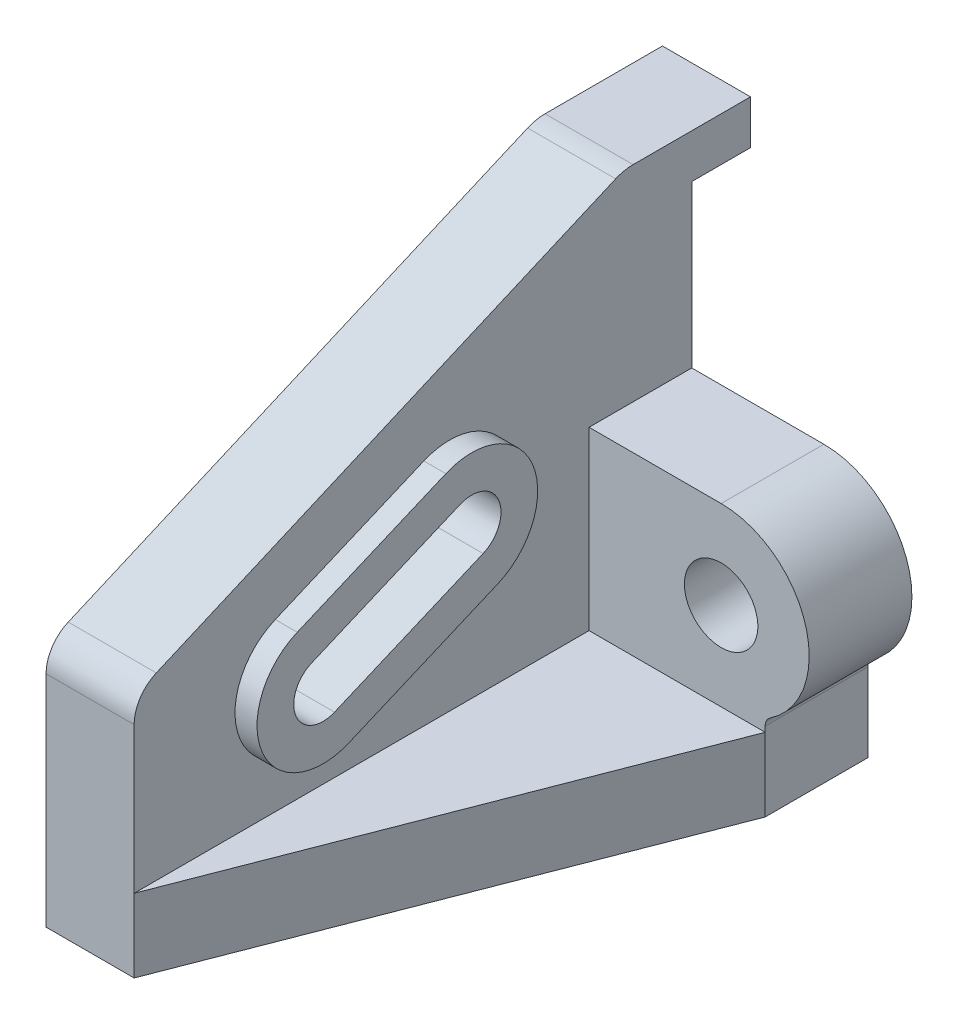
ISO-10303-21;
HEADER;
FILE_DESCRIPTION(('STEP AP214'),'2;1');
FILE_NAME('part.step','',(''),(''),'','','');
FILE_SCHEMA(('AUTOMOTIVE_DESIGN { 1 0 10303 214 1 1 1 1 }'));
ENDSEC;
DATA;
#1=APPLICATION_CONTEXT('core data for automotive mechanical design processes');
#2=APPLICATION_PROTOCOL_DEFINITION('international standard','automotive_design',2000,#1);
#3=PRODUCT_CONTEXT('',#1,'mechanical');
#4=PRODUCT('Part','Part','',(#3));
#5=PRODUCT_RELATED_PRODUCT_CATEGORY('part','',(#4));
#6=PRODUCT_DEFINITION_FORMATION('','',#4);
#7=PRODUCT_DEFINITION_CONTEXT('part definition',#1,'design');
#8=PRODUCT_DEFINITION('design','',#6,#7);
#9=PRODUCT_DEFINITION_SHAPE('','',#8);
#10=(LENGTH_UNIT() NAMED_UNIT(*) SI_UNIT(.MILLI.,.METRE.));
#11=(NAMED_UNIT(*) PLANE_ANGLE_UNIT() SI_UNIT($,.RADIAN.));
#12=(NAMED_UNIT(*) SI_UNIT($,.STERADIAN.) SOLID_ANGLE_UNIT());
#13=UNCERTAINTY_MEASURE_WITH_UNIT(LENGTH_MEASURE(1.E-05),#10,'distance_accuracy_value','');
#14=(GEOMETRIC_REPRESENTATION_CONTEXT(3) GLOBAL_UNCERTAINTY_ASSIGNED_CONTEXT((#13)) GLOBAL_UNIT_ASSIGNED_CONTEXT((#10,
#11,#12)) REPRESENTATION_CONTEXT('',''));
#15=CARTESIAN_POINT('',(0.,0.,0.));
#16=DIRECTION('',(0.,0.,1.));
#17=DIRECTION('',(1.,0.,0.));
#18=AXIS2_PLACEMENT_3D('',#15,#16,#17);
#19=CARTESIAN_POINT('',(19.05,0.,0.));
#20=DIRECTION('',(1.,0.,0.));
#21=DIRECTION('',(0.,0.,-1.));
#22=AXIS2_PLACEMENT_3D('',#19,#20,#21);
#23=PLANE('',#22);
#24=DIRECTION('',(0.,0.,-1.));
#25=VECTOR('',#24,1.);
#26=CARTESIAN_POINT('',(19.05,38.1,-98.425));
#27=LINE('',#26,#25);
#28=CARTESIAN_POINT('',(19.05,38.1,-98.425));
#29=VERTEX_POINT('',#28);
#30=CARTESIAN_POINT('',(19.05,38.1,-120.65));
#31=VERTEX_POINT('',#30);
#32=EDGE_CURVE('E219',#29,#31,#27,.T.);
#33=ORIENTED_EDGE('',*,*,#32,.T.);
#34=DIRECTION('',(0.,1.,0.));
#35=VECTOR('',#34,1.);
#36=CARTESIAN_POINT('',(19.05,0.,-120.65));
#37=LINE('',#36,#35);
#38=CARTESIAN_POINT('',(19.05,73.025,-120.65));
#39=VERTEX_POINT('',#38);
#40=EDGE_CURVE('E318',#31,#39,#37,.T.);
#41=ORIENTED_EDGE('',*,*,#40,.T.);
#42=DIRECTION('',(0.,0.,-1.));
#43=VECTOR('',#42,1.);
#44=CARTESIAN_POINT('',(19.05,73.025,0.));
#45=LINE('',#44,#43);
#46=CARTESIAN_POINT('',(19.05,73.025,-133.35));
#47=VERTEX_POINT('',#46);
#48=EDGE_CURVE('E320',#39,#47,#45,.T.);
#49=ORIENTED_EDGE('',*,*,#48,.T.);
#50=DIRECTION('',(0.,1.,0.));
#51=VECTOR('',#50,1.);
#52=CARTESIAN_POINT('',(19.05,0.,-133.35));
#53=LINE('',#52,#51);
#54=CARTESIAN_POINT('',(19.05,82.55,-133.35));
#55=VERTEX_POINT('',#54);
#56=EDGE_CURVE('E322',#47,#55,#53,.T.);
#57=ORIENTED_EDGE('',*,*,#56,.T.);
#58=DIRECTION('',(0.,0.,1.));
#59=VECTOR('',#58,1.);
#60=CARTESIAN_POINT('',(19.05,82.55,0.));
#61=LINE('',#60,#59);
#62=CARTESIAN_POINT('',(19.05,82.55,-107.95));
#63=VERTEX_POINT('',#62);
#64=EDGE_CURVE('E324',#55,#63,#61,.T.);
#65=ORIENTED_EDGE('',*,*,#64,.T.);
#66=CARTESIAN_POINT('',(19.05,73.025,-107.95));
#67=DIRECTION('',(1.,0.,0.));
#68=DIRECTION('',(0.,0.,-1.));
#69=AXIS2_PLACEMENT_3D('',#66,#67,#68);
#70=CIRCLE('',#69,9.52500000000001);
#71=CARTESIAN_POINT('',(19.05,81.7706306883739,-104.176464673205));
#72=VERTEX_POINT('',#71);
#73=EDGE_CURVE('E326',#63,#72,#70,.T.);
#74=ORIENTED_EDGE('',*,*,#73,.T.);
#75=DIRECTION('',(0.,-0.396171687852546,0.918176450222976));
#76=VECTOR('',#75,1.);
#77=CARTESIAN_POINT('',(19.05,31.0418026918558,13.3938126636027));
#78=LINE('',#77,#76);
#79=CARTESIAN_POINT('',(19.05,38.8889388176448,-4.79288722767042));
#80=VERTEX_POINT('',#79);
#81=EDGE_CURVE('E328',#72,#80,#78,.T.);
#82=ORIENTED_EDGE('',*,*,#81,.T.);
#83=CARTESIAN_POINT('',(19.05,31.6009132439999,-7.9375));
#84=DIRECTION('',(1.,0.,0.));
#85=DIRECTION('',(0.,0.,-1.));
#86=AXIS2_PLACEMENT_3D('',#83,#84,#85);
#87=CIRCLE('',#86,7.9375);
#88=CARTESIAN_POINT('',(19.05,31.6009132439999,0.));
#89=VERTEX_POINT('',#88);
#90=EDGE_CURVE('E312',#80,#89,#87,.T.);
#91=ORIENTED_EDGE('',*,*,#90,.T.);
#92=DIRECTION('',(0.,-1.,0.));
#93=VECTOR('',#92,1.);
#94=CARTESIAN_POINT('',(19.05,0.,0.));
#95=LINE('',#94,#93);
#96=CARTESIAN_POINT('',(19.05,0.,0.));
#97=VERTEX_POINT('',#96);
#98=EDGE_CURVE('E315',#89,#97,#95,.T.);
#99=ORIENTED_EDGE('',*,*,#98,.T.);
#100=DIRECTION('',(0.,0.,1.));
#101=VECTOR('',#100,1.);
#102=CARTESIAN_POINT('',(19.05,0.,0.));
#103=LINE('',#102,#101);
#104=CARTESIAN_POINT('',(19.05,0.,-98.425));
#105=VERTEX_POINT('',#104);
#106=EDGE_CURVE('E223',#105,#97,#103,.T.);
#107=ORIENTED_EDGE('',*,*,#106,.F.);
#108=DIRECTION('',(0.,-1.,0.));
#109=VECTOR('',#108,1.);
#110=CARTESIAN_POINT('',(19.05,0.,-98.425));
#111=LINE('',#110,#109);
#112=EDGE_CURVE('E216',#29,#105,#111,.T.);
#113=ORIENTED_EDGE('',*,*,#112,.F.);
#114=EDGE_LOOP('',(#33,#41,#49,#57,#65,#74,#82,#91,#99,#107,#113));
#115=FACE_BOUND('',#114,.T.);
#116=DIRECTION('',(0.,-0.390731128489268,0.920504853452443));
#117=VECTOR('',#116,1.);
#118=CARTESIAN_POINT('',(19.05,-6.76557277831786,-2.87181526162913));
#119=LINE('',#118,#117);
#120=CARTESIAN_POINT('',(19.05,23.3607869062982,-73.8450709982904));
#121=VERTEX_POINT('',#120);
#122=CARTESIAN_POINT('',(19.05,9.71450224381053,-41.6964389914639));
#123=VERTEX_POINT('',#122);
#124=EDGE_CURVE('E296',#121,#123,#119,.T.);
#125=ORIENTED_EDGE('',*,*,#124,.T.);
#126=CARTESIAN_POINT('',(19.05,22.8662153375123,-36.1138679931735));
#127=DIRECTION('',(1.,0.,0.));
#128=DIRECTION('',(0.,0.,-1.));
#129=AXIS2_PLACEMENT_3D('',#126,#127,#128);
#130=CIRCLE('',#129,14.2875);
#131=CARTESIAN_POINT('',(19.05,36.0179284312141,-30.531296994883));
#132=VERTEX_POINT('',#131);
#133=EDGE_CURVE('E282',#132,#123,#130,.T.);
#134=ORIENTED_EDGE('',*,*,#133,.F.);
#135=DIRECTION('',(0.,-0.390731128489268,0.920504853452443));
#136=VECTOR('',#135,1.);
#137=CARTESIAN_POINT('',(19.05,19.5378534090858,8.29332673495172));
#138=LINE('',#137,#136);
#139=CARTESIAN_POINT('',(19.05,49.6642130937018,-62.6799290017096));
#140=VERTEX_POINT('',#139);
#141=EDGE_CURVE('E286',#140,#132,#138,.T.);
#142=ORIENTED_EDGE('',*,*,#141,.F.);
#143=CARTESIAN_POINT('',(19.05,36.5125,-68.2625));
#144=DIRECTION('',(1.,0.,0.));
#145=DIRECTION('',(0.,0.,-1.));
#146=AXIS2_PLACEMENT_3D('',#143,#144,#145);
#147=CIRCLE('',#146,14.2875);
#148=EDGE_CURVE('E299',#121,#140,#147,.T.);
#149=ORIENTED_EDGE('',*,*,#148,.F.);
#150=EDGE_LOOP('',(#125,#134,#142,#149));
#151=FACE_BOUND('',#150,.T.);
#152=ADVANCED_FACE('F60',(#115,#151),#23,.T.);
#153=CARTESIAN_POINT('',(19.05,22.8662153375123,-36.1138679931735));
#154=DIRECTION('',(-1.,0.,0.));
#155=DIRECTION('',(0.,0.,1.));
#156=AXIS2_PLACEMENT_3D('',#153,#154,#155);
#157=CYLINDRICAL_SURFACE('',#156,6.34999999999999);
#158=CARTESIAN_POINT('',(0.,22.8662153375123,-36.1138679931735));
#159=DIRECTION('',(1.,0.,0.));
#160=DIRECTION('',(0.,0.,-1.));
#161=AXIS2_PLACEMENT_3D('',#158,#159,#160);
#162=CIRCLE('',#161,6.34999999999999);
#163=CARTESIAN_POINT('',(0.,28.7114211569353,-33.6327253272666));
#164=VERTEX_POINT('',#163);
#165=CARTESIAN_POINT('',(0.,17.0210095180893,-38.5950106590803));
#166=VERTEX_POINT('',#165);
#167=EDGE_CURVE('E350',#164,#166,#162,.T.);
#168=ORIENTED_EDGE('',*,*,#167,.F.);
#169=DIRECTION('',(-1.,0.,0.));
#170=VECTOR('',#169,1.);
#171=CARTESIAN_POINT('',(19.05,28.7114211569353,-33.6327253272666));
#172=LINE('',#171,#170);
#173=CARTESIAN_POINT('',(23.8125,28.7114211569353,-33.6327253272666));
#174=VERTEX_POINT('',#173);
#175=EDGE_CURVE('E368',#174,#164,#172,.T.);
#176=ORIENTED_EDGE('',*,*,#175,.F.);
#177=CARTESIAN_POINT('',(23.8125,22.8662153375123,-36.1138679931735));
#178=DIRECTION('',(1.,0.,0.));
#179=DIRECTION('',(0.,0.,-1.));
#180=AXIS2_PLACEMENT_3D('',#177,#178,#179);
#181=CIRCLE('',#180,6.34999999999999);
#182=CARTESIAN_POINT('',(23.8125,17.0210095180893,-38.5950106590803));
#183=VERTEX_POINT('',#182);
#184=EDGE_CURVE('E273',#174,#183,#181,.T.);
#185=ORIENTED_EDGE('',*,*,#184,.T.);
#186=DIRECTION('',(-1.,0.,0.));
#187=VECTOR('',#186,1.);
#188=CARTESIAN_POINT('',(19.05,17.0210095180893,-38.5950106590803));
#189=LINE('',#188,#187);
#190=EDGE_CURVE('E361',#183,#166,#189,.T.);
#191=ORIENTED_EDGE('',*,*,#190,.T.);
#192=EDGE_LOOP('',(#168,#176,#185,#191));
#193=FACE_BOUND('',#192,.T.);
#194=ADVANCED_FACE('F441',(#193),#157,.F.);
#195=CARTESIAN_POINT('',(19.05,12.2313461348069,5.19189840256815));
#196=DIRECTION('',(0.,0.920504853452443,0.390731128489268));
#197=DIRECTION('',(0.,-0.390731128489268,0.920504853452443));
#198=AXIS2_PLACEMENT_3D('',#195,#196,#197);
#199=PLANE('',#198);
#200=DIRECTION('',(0.,0.390731128489268,-0.920504853452443));
#201=VECTOR('',#200,1.);
#202=CARTESIAN_POINT('',(0.,12.2313461348069,5.19189840256815));
#203=LINE('',#202,#201);
#204=CARTESIAN_POINT('',(0.,42.357705819423,-65.7813573340932));
#205=VERTEX_POINT('',#204);
#206=EDGE_CURVE('E353',#164,#205,#203,.T.);
#207=ORIENTED_EDGE('',*,*,#206,.T.);
#208=DIRECTION('',(-1.,0.,0.));
#209=VECTOR('',#208,1.);
#210=CARTESIAN_POINT('',(19.05,42.357705819423,-65.7813573340932));
#211=LINE('',#210,#209);
#212=CARTESIAN_POINT('',(23.8125,42.357705819423,-65.7813573340932));
#213=VERTEX_POINT('',#212);
#214=EDGE_CURVE('E366',#213,#205,#211,.T.);
#215=ORIENTED_EDGE('',*,*,#214,.F.);
#216=DIRECTION('',(0.,-0.390731128489268,0.920504853452443));
#217=VECTOR('',#216,1.);
#218=CARTESIAN_POINT('',(23.8125,12.2313461348069,5.19189840256815));
#219=LINE('',#218,#217);
#220=EDGE_CURVE('E276',#213,#174,#219,.T.);
#221=ORIENTED_EDGE('',*,*,#220,.T.);
#222=ORIENTED_EDGE('',*,*,#175,.T.);
#223=EDGE_LOOP('',(#207,#215,#221,#222));
#224=FACE_BOUND('',#223,.T.);
#225=ADVANCED_FACE('F446',(#224),#199,.F.);
#226=CARTESIAN_POINT('',(19.05,36.5125,-68.2625));
#227=DIRECTION('',(-1.,0.,0.));
#228=DIRECTION('',(0.,0.,1.));
#229=AXIS2_PLACEMENT_3D('',#226,#227,#228);
#230=CYLINDRICAL_SURFACE('',#229,6.34999999999999);
#231=CARTESIAN_POINT('',(0.,36.5125,-68.2625));
#232=DIRECTION('',(1.,0.,0.));
#233=DIRECTION('',(0.,0.,-1.));
#234=AXIS2_PLACEMENT_3D('',#231,#232,#233);
#235=CIRCLE('',#234,6.34999999999999);
#236=CARTESIAN_POINT('',(0.,30.667294180577,-70.7436426659068));
#237=VERTEX_POINT('',#236);
#238=EDGE_CURVE('E356',#237,#205,#235,.T.);
#239=ORIENTED_EDGE('',*,*,#238,.F.);
#240=DIRECTION('',(-1.,0.,0.));
#241=VECTOR('',#240,1.);
#242=CARTESIAN_POINT('',(19.05,30.667294180577,-70.7436426659068));
#243=LINE('',#242,#241);
#244=CARTESIAN_POINT('',(23.8125,30.667294180577,-70.7436426659069));
#245=VERTEX_POINT('',#244);
#246=EDGE_CURVE('E363',#245,#237,#243,.T.);
#247=ORIENTED_EDGE('',*,*,#246,.F.);
#248=CARTESIAN_POINT('',(23.8125,36.5125,-68.2625));
#249=DIRECTION('',(1.,0.,0.));
#250=DIRECTION('',(0.,0.,-1.));
#251=AXIS2_PLACEMENT_3D('',#248,#249,#250);
#252=CIRCLE('',#251,6.34999999999999);
#253=EDGE_CURVE('E279',#245,#213,#252,.T.);
#254=ORIENTED_EDGE('',*,*,#253,.T.);
#255=ORIENTED_EDGE('',*,*,#214,.T.);
#256=EDGE_LOOP('',(#239,#247,#254,#255));
#257=FACE_BOUND('',#256,.T.);
#258=ADVANCED_FACE('F460',(#257),#230,.F.);
#259=CARTESIAN_POINT('',(19.05,31.6009132439999,-7.9375));
#260=DIRECTION('',(-1.,0.,0.));
#261=DIRECTION('',(0.,0.,1.));
#262=AXIS2_PLACEMENT_3D('',#259,#260,#261);
#263=CYLINDRICAL_SURFACE('',#262,7.9375);
#264=CARTESIAN_POINT('',(0.,31.6009132439999,-7.9375));
#265=DIRECTION('',(1.,0.,0.));
#266=DIRECTION('',(0.,0.,-1.));
#267=AXIS2_PLACEMENT_3D('',#264,#265,#266);
#268=CIRCLE('',#267,7.9375);
#269=CARTESIAN_POINT('',(0.,38.8889388176448,-4.79288722767042));
#270=VERTEX_POINT('',#269);
#271=CARTESIAN_POINT('',(0.,31.6009132439999,0.));
#272=VERTEX_POINT('',#271);
#273=EDGE_CURVE('E311',#270,#272,#268,.T.);
#274=ORIENTED_EDGE('',*,*,#273,.T.);
#275=DIRECTION('',(-1.,0.,0.));
#276=VECTOR('',#275,1.);
#277=CARTESIAN_POINT('',(19.05,31.6009132439999,0.));
#278=LINE('',#277,#276);
#279=EDGE_CURVE('E364',#89,#272,#278,.T.);
#280=ORIENTED_EDGE('',*,*,#279,.F.);
#281=ORIENTED_EDGE('',*,*,#90,.F.);
#282=DIRECTION('',(-1.,0.,0.));
#283=VECTOR('',#282,1.);
#284=CARTESIAN_POINT('',(19.05,38.8889388176448,-4.79288722767042));
#285=LINE('',#284,#283);
#286=EDGE_CURVE('E330',#80,#270,#285,.T.);
#287=ORIENTED_EDGE('',*,*,#286,.T.);
#288=EDGE_LOOP('',(#274,#280,#281,#287));
#289=FACE_BOUND('',#288,.T.);
#290=ADVANCED_FACE('F418',(#289),#263,.T.);
#291=CARTESIAN_POINT('',(19.05,0.,0.));
#292=DIRECTION('',(0.,0.,-1.));
#293=DIRECTION('',(0.,1.,0.));
#294=AXIS2_PLACEMENT_3D('',#291,#292,#293);
#295=PLANE('',#294);
#296=DIRECTION('',(-1.,0.,0.));
#297=VECTOR('',#296,1.);
#298=CARTESIAN_POINT('',(19.05,-15.875,0.));
#299=LINE('',#298,#297);
#300=CARTESIAN_POINT('',(19.05,-15.875,0.));
#301=VERTEX_POINT('',#300);
#302=CARTESIAN_POINT('',(0.,-15.875,0.));
#303=VERTEX_POINT('',#302);
#304=EDGE_CURVE('E391',#301,#303,#299,.T.);
#305=ORIENTED_EDGE('',*,*,#304,.F.);
#306=DIRECTION('',(0.,1.,0.));
#307=VECTOR('',#306,1.);
#308=CARTESIAN_POINT('',(19.05,-15.875,0.));
#309=LINE('',#308,#307);
#310=EDGE_CURVE('E226',#301,#97,#309,.T.);
#311=ORIENTED_EDGE('',*,*,#310,.T.);
#312=ORIENTED_EDGE('',*,*,#98,.F.);
#313=ORIENTED_EDGE('',*,*,#279,.T.);
#314=DIRECTION('',(0.,-1.,0.));
#315=VECTOR('',#314,1.);
#316=CARTESIAN_POINT('',(0.,0.,0.));
#317=LINE('',#316,#315);
#318=EDGE_CURVE('E333',#272,#303,#317,.T.);
#319=ORIENTED_EDGE('',*,*,#318,.T.);
#320=EDGE_LOOP('',(#305,#311,#312,#313,#319));
#321=FACE_BOUND('',#320,.T.);
#322=ADVANCED_FACE('F412',(#321),#295,.F.);
#323=CARTESIAN_POINT('',(19.05,-15.875,0.));
#324=DIRECTION('',(0.,1.,0.));
#325=DIRECTION('',(0.,0.,1.));
#326=AXIS2_PLACEMENT_3D('',#323,#324,#325);
#327=PLANE('',#326);
#328=DIRECTION('',(0.,0.,1.));
#329=VECTOR('',#328,1.);
#330=CARTESIAN_POINT('',(57.15,-15.875,0.));
#331=LINE('',#330,#329);
#332=CARTESIAN_POINT('',(57.15,-15.875,-120.65));
#333=VERTEX_POINT('',#332);
#334=CARTESIAN_POINT('',(57.15,-15.875,-98.425));
#335=VERTEX_POINT('',#334);
#336=EDGE_CURVE('E262',#333,#335,#331,.T.);
#337=ORIENTED_EDGE('',*,*,#336,.T.);
#338=DIRECTION('',(-0.360994102557712,0.,0.932568098274089));
#339=VECTOR('',#338,1.);
#340=CARTESIAN_POINT('',(19.05,-15.875,0.));
#341=LINE('',#340,#339);
#342=EDGE_CURVE('E251',#335,#301,#341,.T.);
#343=ORIENTED_EDGE('',*,*,#342,.T.);
#344=ORIENTED_EDGE('',*,*,#304,.T.);
#345=DIRECTION('',(0.,0.,-1.));
#346=VECTOR('',#345,1.);
#347=CARTESIAN_POINT('',(0.,-15.875,0.));
#348=LINE('',#347,#346);
#349=CARTESIAN_POINT('',(0.,-15.875,-120.65));
#350=VERTEX_POINT('',#349);
#351=EDGE_CURVE('E336',#303,#350,#348,.T.);
#352=ORIENTED_EDGE('',*,*,#351,.T.);
#353=DIRECTION('',(-1.,0.,0.));
#354=VECTOR('',#353,1.);
#355=CARTESIAN_POINT('',(19.05,-15.875,-120.65));
#356=LINE('',#355,#354);
#357=EDGE_CURVE('E388',#333,#350,#356,.T.);
#358=ORIENTED_EDGE('',*,*,#357,.F.);
#359=EDGE_LOOP('',(#337,#343,#344,#352,#358));
#360=FACE_BOUND('',#359,.T.);
#361=ADVANCED_FACE('F428',(#360),#327,.F.);
#362=CARTESIAN_POINT('',(19.05,0.,-120.65));
#363=DIRECTION('',(0.,0.,1.));
#364=DIRECTION('',(1.,0.,0.));
#365=AXIS2_PLACEMENT_3D('',#362,#363,#364);
#366=PLANE('',#365);
#367=ORIENTED_EDGE('',*,*,#40,.F.);
#368=DIRECTION('',(1.,0.,0.));
#369=VECTOR('',#368,1.);
#370=CARTESIAN_POINT('',(47.625,38.1,-120.65));
#371=LINE('',#370,#369);
#372=CARTESIAN_POINT('',(47.625,38.1,-120.65));
#373=VERTEX_POINT('',#372);
#374=EDGE_CURVE('E233',#31,#373,#371,.T.);
#375=ORIENTED_EDGE('',*,*,#374,.T.);
#376=CARTESIAN_POINT('',(47.625,19.05,-120.65));
#377=DIRECTION('',(0.,0.,-1.));
#378=DIRECTION('',(-1.,0.,0.));
#379=AXIS2_PLACEMENT_3D('',#376,#377,#378);
#380=CIRCLE('',#379,19.05);
#381=CARTESIAN_POINT('',(58.2705882352941,3.25209029255556,-120.65));
#382=VERTEX_POINT('',#381);
#383=EDGE_CURVE('E239',#373,#382,#380,.T.);
#384=ORIENTED_EDGE('',*,*,#383,.T.);
#385=CARTESIAN_POINT('',(59.69,1.14570233156296,-120.65));
#386=DIRECTION('',(0.,0.,1.));
#387=DIRECTION('',(1.,0.,0.));
#388=AXIS2_PLACEMENT_3D('',#385,#386,#387);
#389=CIRCLE('',#388,2.54);
#390=CARTESIAN_POINT('',(57.15,1.14570233156296,-120.65));
#391=VERTEX_POINT('',#390);
#392=EDGE_CURVE('E12',#382,#391,#389,.T.);
#393=ORIENTED_EDGE('',*,*,#392,.T.);
#394=DIRECTION('',(0.,-1.,0.));
#395=VECTOR('',#394,1.);
#396=CARTESIAN_POINT('',(57.15,0.,-120.65));
#397=LINE('',#396,#395);
#398=EDGE_CURVE('E265',#391,#333,#397,.T.);
#399=ORIENTED_EDGE('',*,*,#398,.T.);
#400=ORIENTED_EDGE('',*,*,#357,.T.);
#401=DIRECTION('',(0.,1.,0.));
#402=VECTOR('',#401,1.);
#403=CARTESIAN_POINT('',(0.,0.,-120.65));
#404=LINE('',#403,#402);
#405=CARTESIAN_POINT('',(0.,73.025,-120.65));
#406=VERTEX_POINT('',#405);
#407=EDGE_CURVE('E338',#350,#406,#404,.T.);
#408=ORIENTED_EDGE('',*,*,#407,.T.);
#409=DIRECTION('',(-1.,0.,0.));
#410=VECTOR('',#409,1.);
#411=CARTESIAN_POINT('',(19.05,73.025,-120.65));
#412=LINE('',#411,#410);
#413=EDGE_CURVE('E385',#39,#406,#412,.T.);
#414=ORIENTED_EDGE('',*,*,#413,.F.);
#415=EDGE_LOOP('',(#367,#375,#384,#393,#399,#400,#408,#414));
#416=FACE_BOUND('',#415,.T.);
#417=CARTESIAN_POINT('',(47.625,19.05,-120.65));
#418=DIRECTION('',(0.,0.,-1.));
#419=DIRECTION('',(-1.,0.,0.));
#420=AXIS2_PLACEMENT_3D('',#417,#418,#419);
#421=CIRCLE('',#420,7.9375);
#422=CARTESIAN_POINT('',(39.6875,19.05,-120.65));
#423=VERTEX_POINT('',#422);
#424=EDGE_CURVE('E244',#423,#423,#421,.T.);
#425=ORIENTED_EDGE('',*,*,#424,.F.);
#426=EDGE_LOOP('',(#425));
#427=FACE_BOUND('',#426,.T.);
#428=ADVANCED_FACE('F430',(#416,#427),#366,.F.);
#429=CARTESIAN_POINT('',(19.05,73.025,0.));
#430=DIRECTION('',(0.,1.,0.));
#431=DIRECTION('',(0.,0.,1.));
#432=AXIS2_PLACEMENT_3D('',#429,#430,#431);
#433=PLANE('',#432);
#434=DIRECTION('',(0.,0.,-1.));
#435=VECTOR('',#434,1.);
#436=CARTESIAN_POINT('',(0.,73.025,0.));
#437=LINE('',#436,#435);
#438=CARTESIAN_POINT('',(0.,73.025,-133.35));
#439=VERTEX_POINT('',#438);
#440=EDGE_CURVE('E340',#406,#439,#437,.T.);
#441=ORIENTED_EDGE('',*,*,#440,.T.);
#442=DIRECTION('',(-1.,0.,0.));
#443=VECTOR('',#442,1.);
#444=CARTESIAN_POINT('',(19.05,73.025,-133.35));
#445=LINE('',#444,#443);
#446=EDGE_CURVE('E382',#47,#439,#445,.T.);
#447=ORIENTED_EDGE('',*,*,#446,.F.);
#448=ORIENTED_EDGE('',*,*,#48,.F.);
#449=ORIENTED_EDGE('',*,*,#413,.T.);
#450=EDGE_LOOP('',(#441,#447,#448,#449));
#451=FACE_BOUND('',#450,.T.);
#452=ADVANCED_FACE('F481',(#451),#433,.F.);
#453=CARTESIAN_POINT('',(19.05,0.,-133.35));
#454=DIRECTION('',(0.,0.,1.));
#455=DIRECTION('',(1.,0.,0.));
#456=AXIS2_PLACEMENT_3D('',#453,#454,#455);
#457=PLANE('',#456);
#458=DIRECTION('',(0.,1.,0.));
#459=VECTOR('',#458,1.);
#460=CARTESIAN_POINT('',(0.,0.,-133.35));
#461=LINE('',#460,#459);
#462=CARTESIAN_POINT('',(0.,82.55,-133.35));
#463=VERTEX_POINT('',#462);
#464=EDGE_CURVE('E342',#439,#463,#461,.T.);
#465=ORIENTED_EDGE('',*,*,#464,.T.);
#466=DIRECTION('',(-1.,0.,0.));
#467=VECTOR('',#466,1.);
#468=CARTESIAN_POINT('',(19.05,82.55,-133.35));
#469=LINE('',#468,#467);
#470=EDGE_CURVE('E379',#55,#463,#469,.T.);
#471=ORIENTED_EDGE('',*,*,#470,.F.);
#472=ORIENTED_EDGE('',*,*,#56,.F.);
#473=ORIENTED_EDGE('',*,*,#446,.T.);
#474=EDGE_LOOP('',(#465,#471,#472,#473));
#475=FACE_BOUND('',#474,.T.);
#476=ADVANCED_FACE('F477',(#475),#457,.F.);
#477=CARTESIAN_POINT('',(19.05,82.55,0.));
#478=DIRECTION('',(0.,-1.,0.));
#479=DIRECTION('',(0.,0.,-1.));
#480=AXIS2_PLACEMENT_3D('',#477,#478,#479);
#481=PLANE('',#480);
#482=DIRECTION('',(0.,0.,1.));
#483=VECTOR('',#482,1.);
#484=CARTESIAN_POINT('',(0.,82.55,0.));
#485=LINE('',#484,#483);
#486=CARTESIAN_POINT('',(0.,82.55,-107.95));
#487=VERTEX_POINT('',#486);
#488=EDGE_CURVE('E344',#463,#487,#485,.T.);
#489=ORIENTED_EDGE('',*,*,#488,.T.);
#490=DIRECTION('',(-1.,0.,0.));
#491=VECTOR('',#490,1.);
#492=CARTESIAN_POINT('',(19.05,82.55,-107.95));
#493=LINE('',#492,#491);
#494=EDGE_CURVE('E376',#63,#487,#493,.T.);
#495=ORIENTED_EDGE('',*,*,#494,.F.);
#496=ORIENTED_EDGE('',*,*,#64,.F.);
#497=ORIENTED_EDGE('',*,*,#470,.T.);
#498=EDGE_LOOP('',(#489,#495,#496,#497));
#499=FACE_BOUND('',#498,.T.);
#500=ADVANCED_FACE('F473',(#499),#481,.F.);
#501=CARTESIAN_POINT('',(19.05,73.025,-107.95));
#502=DIRECTION('',(-1.,0.,0.));
#503=DIRECTION('',(0.,0.,1.));
#504=AXIS2_PLACEMENT_3D('',#501,#502,#503);
#505=CYLINDRICAL_SURFACE('',#504,9.52500000000001);
#506=CARTESIAN_POINT('',(0.,73.025,-107.95));
#507=DIRECTION('',(1.,0.,0.));
#508=DIRECTION('',(0.,0.,-1.));
#509=AXIS2_PLACEMENT_3D('',#506,#507,#508);
#510=CIRCLE('',#509,9.52500000000001);
#511=CARTESIAN_POINT('',(0.,81.7706306883739,-104.176464673205));
#512=VERTEX_POINT('',#511);
#513=EDGE_CURVE('E346',#487,#512,#510,.T.);
#514=ORIENTED_EDGE('',*,*,#513,.T.);
#515=DIRECTION('',(-1.,0.,0.));
#516=VECTOR('',#515,1.);
#517=CARTESIAN_POINT('',(19.05,81.7706306883739,-104.176464673205));
#518=LINE('',#517,#516);
#519=EDGE_CURVE('E373',#72,#512,#518,.T.);
#520=ORIENTED_EDGE('',*,*,#519,.F.);
#521=ORIENTED_EDGE('',*,*,#73,.F.);
#522=ORIENTED_EDGE('',*,*,#494,.T.);
#523=EDGE_LOOP('',(#514,#520,#521,#522));
#524=FACE_BOUND('',#523,.T.);
#525=ADVANCED_FACE('F469',(#524),#505,.T.);
#526=CARTESIAN_POINT('',(19.05,31.0418026918558,13.3938126636027));
#527=DIRECTION('',(0.,-0.918176450222976,-0.396171687852546));
#528=DIRECTION('',(0.,0.396171687852546,-0.918176450222976));
#529=AXIS2_PLACEMENT_3D('',#526,#527,#528);
#530=PLANE('',#529);
#531=DIRECTION('',(0.,-0.396171687852546,0.918176450222976));
#532=VECTOR('',#531,1.);
#533=CARTESIAN_POINT('',(0.,31.0418026918558,13.3938126636027));
#534=LINE('',#533,#532);
#535=EDGE_CURVE('E348',#512,#270,#534,.T.);
#536=ORIENTED_EDGE('',*,*,#535,.T.);
#537=ORIENTED_EDGE('',*,*,#286,.F.);
#538=ORIENTED_EDGE('',*,*,#81,.F.);
#539=ORIENTED_EDGE('',*,*,#519,.T.);
#540=EDGE_LOOP('',(#536,#537,#538,#539));
#541=FACE_BOUND('',#540,.T.);
#542=ADVANCED_FACE('F458',(#541),#530,.F.);
#543=CARTESIAN_POINT('',(19.05,0.540934495960936,0.22961307075445));
#544=DIRECTION('',(0.,0.920504853452443,0.390731128489268));
#545=DIRECTION('',(0.,-0.390731128489268,0.920504853452443));
#546=AXIS2_PLACEMENT_3D('',#543,#544,#545);
#547=PLANE('',#546);
#548=DIRECTION('',(0.,0.390731128489268,-0.920504853452443));
#549=VECTOR('',#548,1.);
#550=CARTESIAN_POINT('',(0.,0.540934495960936,0.22961307075445));
#551=LINE('',#550,#549);
#552=EDGE_CURVE('E316',#166,#237,#551,.T.);
#553=ORIENTED_EDGE('',*,*,#552,.F.);
#554=ORIENTED_EDGE('',*,*,#190,.F.);
#555=DIRECTION('',(0.,-0.390731128489268,0.920504853452443));
#556=VECTOR('',#555,1.);
#557=CARTESIAN_POINT('',(23.8125,0.540934495960936,0.22961307075445));
#558=LINE('',#557,#556);
#559=EDGE_CURVE('E270',#245,#183,#558,.T.);
#560=ORIENTED_EDGE('',*,*,#559,.F.);
#561=ORIENTED_EDGE('',*,*,#246,.T.);
#562=EDGE_LOOP('',(#553,#554,#560,#561));
#563=FACE_BOUND('',#562,.T.);
#564=ADVANCED_FACE('F455',(#563),#547,.T.);
#565=CARTESIAN_POINT('',(0.,0.,0.));
#566=DIRECTION('',(1.,0.,0.));
#567=DIRECTION('',(0.,0.,-1.));
#568=AXIS2_PLACEMENT_3D('',#565,#566,#567);
#569=PLANE('',#568);
#570=ORIENTED_EDGE('',*,*,#273,.F.);
#571=ORIENTED_EDGE('',*,*,#535,.F.);
#572=ORIENTED_EDGE('',*,*,#513,.F.);
#573=ORIENTED_EDGE('',*,*,#488,.F.);
#574=ORIENTED_EDGE('',*,*,#464,.F.);
#575=ORIENTED_EDGE('',*,*,#440,.F.);
#576=ORIENTED_EDGE('',*,*,#407,.F.);
#577=ORIENTED_EDGE('',*,*,#351,.F.);
#578=ORIENTED_EDGE('',*,*,#318,.F.);
#579=EDGE_LOOP('',(#570,#571,#572,#573,#574,#575,#576,#577,#578));
#580=FACE_BOUND('',#579,.T.);
#581=ORIENTED_EDGE('',*,*,#167,.T.);
#582=ORIENTED_EDGE('',*,*,#552,.T.);
#583=ORIENTED_EDGE('',*,*,#238,.T.);
#584=ORIENTED_EDGE('',*,*,#206,.F.);
#585=EDGE_LOOP('',(#581,#582,#583,#584));
#586=FACE_BOUND('',#585,.T.);
#587=ADVANCED_FACE('F423',(#580,#586),#569,.F.);
#588=CARTESIAN_POINT('',(23.8125,22.8662153375123,-36.1138679931735));
#589=DIRECTION('',(-1.,0.,0.));
#590=DIRECTION('',(0.,0.,1.));
#591=AXIS2_PLACEMENT_3D('',#588,#589,#590);
#592=CYLINDRICAL_SURFACE('',#591,14.2875);
#593=ORIENTED_EDGE('',*,*,#133,.T.);
#594=DIRECTION('',(-1.,0.,0.));
#595=VECTOR('',#594,1.);
#596=CARTESIAN_POINT('',(23.8125,9.71450224381053,-41.6964389914639));
#597=LINE('',#596,#595);
#598=CARTESIAN_POINT('',(23.8125,9.71450224381053,-41.6964389914639));
#599=VERTEX_POINT('',#598);
#600=EDGE_CURVE('E309',#599,#123,#597,.T.);
#601=ORIENTED_EDGE('',*,*,#600,.F.);
#602=CARTESIAN_POINT('',(23.8125,22.8662153375123,-36.1138679931735));
#603=DIRECTION('',(1.,0.,0.));
#604=DIRECTION('',(0.,0.,-1.));
#605=AXIS2_PLACEMENT_3D('',#602,#603,#604);
#606=CIRCLE('',#605,14.2875);
#607=CARTESIAN_POINT('',(23.8125,36.0179284312141,-30.531296994883));
#608=VERTEX_POINT('',#607);
#609=EDGE_CURVE('E283',#608,#599,#606,.T.);
#610=ORIENTED_EDGE('',*,*,#609,.F.);
#611=DIRECTION('',(-1.,0.,0.));
#612=VECTOR('',#611,1.);
#613=CARTESIAN_POINT('',(23.8125,36.0179284312141,-30.531296994883));
#614=LINE('',#613,#612);
#615=EDGE_CURVE('E293',#608,#132,#614,.T.);
#616=ORIENTED_EDGE('',*,*,#615,.T.);
#617=EDGE_LOOP('',(#593,#601,#610,#616));
#618=FACE_BOUND('',#617,.T.);
#619=ADVANCED_FACE('F451',(#618),#592,.T.);
#620=CARTESIAN_POINT('',(23.8125,-6.76557277831786,-2.87181526162913));
#621=DIRECTION('',(0.,-0.920504853452443,-0.390731128489268));
#622=DIRECTION('',(0.,0.390731128489268,-0.920504853452443));
#623=AXIS2_PLACEMENT_3D('',#620,#621,#622);
#624=PLANE('',#623);
#625=ORIENTED_EDGE('',*,*,#124,.F.);
#626=DIRECTION('',(-1.,0.,0.));
#627=VECTOR('',#626,1.);
#628=CARTESIAN_POINT('',(23.8125,23.3607869062982,-73.8450709982904));
#629=LINE('',#628,#627);
#630=CARTESIAN_POINT('',(23.8125,23.3607869062982,-73.8450709982904));
#631=VERTEX_POINT('',#630);
#632=EDGE_CURVE('E307',#631,#121,#629,.T.);
#633=ORIENTED_EDGE('',*,*,#632,.F.);
#634=DIRECTION('',(0.,-0.390731128489268,0.920504853452443));
#635=VECTOR('',#634,1.);
#636=CARTESIAN_POINT('',(23.8125,-6.76557277831786,-2.87181526162913));
#637=LINE('',#636,#635);
#638=EDGE_CURVE('E285',#631,#599,#637,.T.);
#639=ORIENTED_EDGE('',*,*,#638,.T.);
#640=ORIENTED_EDGE('',*,*,#600,.T.);
#641=EDGE_LOOP('',(#625,#633,#639,#640));
#642=FACE_BOUND('',#641,.T.);
#643=ADVANCED_FACE('F547',(#642),#624,.T.);
#644=CARTESIAN_POINT('',(23.8125,36.5125,-68.2625));
#645=DIRECTION('',(-1.,0.,0.));
#646=DIRECTION('',(0.,0.,1.));
#647=AXIS2_PLACEMENT_3D('',#644,#645,#646);
#648=CYLINDRICAL_SURFACE('',#647,14.2875);
#649=ORIENTED_EDGE('',*,*,#148,.T.);
#650=DIRECTION('',(-1.,0.,0.));
#651=VECTOR('',#650,1.);
#652=CARTESIAN_POINT('',(23.8125,49.6642130937018,-62.6799290017096));
#653=LINE('',#652,#651);
#654=CARTESIAN_POINT('',(23.8125,49.6642130937018,-62.6799290017096));
#655=VERTEX_POINT('',#654);
#656=EDGE_CURVE('E305',#655,#140,#653,.T.);
#657=ORIENTED_EDGE('',*,*,#656,.F.);
#658=CARTESIAN_POINT('',(23.8125,36.5125,-68.2625));
#659=DIRECTION('',(1.,0.,0.));
#660=DIRECTION('',(0.,0.,-1.));
#661=AXIS2_PLACEMENT_3D('',#658,#659,#660);
#662=CIRCLE('',#661,14.2875);
#663=EDGE_CURVE('E289',#631,#655,#662,.T.);
#664=ORIENTED_EDGE('',*,*,#663,.F.);
#665=ORIENTED_EDGE('',*,*,#632,.T.);
#666=EDGE_LOOP('',(#649,#657,#664,#665));
#667=FACE_BOUND('',#666,.T.);
#668=ADVANCED_FACE('F554',(#667),#648,.T.);
#669=CARTESIAN_POINT('',(23.8125,19.5378534090858,8.29332673495172));
#670=DIRECTION('',(0.,-0.920504853452443,-0.390731128489268));
#671=DIRECTION('',(0.,0.390731128489268,-0.920504853452443));
#672=AXIS2_PLACEMENT_3D('',#669,#670,#671);
#673=PLANE('',#672);
#674=ORIENTED_EDGE('',*,*,#141,.T.);
#675=ORIENTED_EDGE('',*,*,#615,.F.);
#676=DIRECTION('',(0.,-0.390731128489268,0.920504853452443));
#677=VECTOR('',#676,1.);
#678=CARTESIAN_POINT('',(23.8125,19.5378534090858,8.29332673495172));
#679=LINE('',#678,#677);
#680=EDGE_CURVE('E291',#655,#608,#679,.T.);
#681=ORIENTED_EDGE('',*,*,#680,.F.);
#682=ORIENTED_EDGE('',*,*,#656,.T.);
#683=EDGE_LOOP('',(#674,#675,#681,#682));
#684=FACE_BOUND('',#683,.T.);
#685=ADVANCED_FACE('F561',(#684),#673,.F.);
#686=CARTESIAN_POINT('',(23.8125,22.8662153375123,-36.1138679931735));
#687=DIRECTION('',(1.,0.,0.));
#688=DIRECTION('',(0.,0.,-1.));
#689=AXIS2_PLACEMENT_3D('',#686,#687,#688);
#690=PLANE('',#689);
#691=ORIENTED_EDGE('',*,*,#559,.T.);
#692=ORIENTED_EDGE('',*,*,#184,.F.);
#693=ORIENTED_EDGE('',*,*,#220,.F.);
#694=ORIENTED_EDGE('',*,*,#253,.F.);
#695=EDGE_LOOP('',(#691,#692,#693,#694));
#696=FACE_BOUND('',#695,.T.);
#697=ORIENTED_EDGE('',*,*,#609,.T.);
#698=ORIENTED_EDGE('',*,*,#638,.F.);
#699=ORIENTED_EDGE('',*,*,#663,.T.);
#700=ORIENTED_EDGE('',*,*,#680,.T.);
#701=EDGE_LOOP('',(#697,#698,#699,#700));
#702=FACE_BOUND('',#701,.T.);
#703=ADVANCED_FACE('F569',(#696,#702),#690,.T.);
#704=CARTESIAN_POINT('',(57.15,0.,-98.425));
#705=DIRECTION('',(0.,0.,-1.));
#706=DIRECTION('',(-1.,0.,0.));
#707=AXIS2_PLACEMENT_3D('',#704,#705,#706);
#708=PLANE('',#707);
#709=DIRECTION('',(0.,-1.,0.));
#710=VECTOR('',#709,1.);
#711=CARTESIAN_POINT('',(57.15,0.,-98.425));
#712=LINE('',#711,#710);
#713=CARTESIAN_POINT('',(57.15,1.14570233156296,-98.425));
#714=VERTEX_POINT('',#713);
#715=CARTESIAN_POINT('',(57.15,0.,-98.425));
#716=VERTEX_POINT('',#715);
#717=EDGE_CURVE('E260',#714,#716,#712,.T.);
#718=ORIENTED_EDGE('',*,*,#717,.F.);
#719=CARTESIAN_POINT('',(59.69,1.14570233156296,-98.425));
#720=DIRECTION('',(0.,0.,-1.));
#721=DIRECTION('',(-1.,0.,0.));
#722=AXIS2_PLACEMENT_3D('',#719,#720,#721);
#723=CIRCLE('',#722,2.54);
#724=CARTESIAN_POINT('',(58.2705882352941,3.25209029255556,-98.425));
#725=VERTEX_POINT('',#724);
#726=EDGE_CURVE('E68',#714,#725,#723,.T.);
#727=ORIENTED_EDGE('',*,*,#726,.T.);
#728=CARTESIAN_POINT('',(47.625,19.05,-98.425));
#729=DIRECTION('',(0.,0.,-1.));
#730=DIRECTION('',(-1.,0.,0.));
#731=AXIS2_PLACEMENT_3D('',#728,#729,#730);
#732=CIRCLE('',#731,19.05);
#733=CARTESIAN_POINT('',(47.625,38.1,-98.425));
#734=VERTEX_POINT('',#733);
#735=EDGE_CURVE('E235',#734,#725,#732,.T.);
#736=ORIENTED_EDGE('',*,*,#735,.F.);
#737=DIRECTION('',(1.,0.,0.));
#738=VECTOR('',#737,1.);
#739=CARTESIAN_POINT('',(47.625,38.1,-98.425));
#740=LINE('',#739,#738);
#741=EDGE_CURVE('E231',#29,#734,#740,.T.);
#742=ORIENTED_EDGE('',*,*,#741,.F.);
#743=ORIENTED_EDGE('',*,*,#112,.T.);
#744=DIRECTION('',(-1.,0.,0.));
#745=VECTOR('',#744,1.);
#746=CARTESIAN_POINT('',(57.15,0.,-98.425));
#747=LINE('',#746,#745);
#748=EDGE_CURVE('E266',#716,#105,#747,.T.);
#749=ORIENTED_EDGE('',*,*,#748,.F.);
#750=EDGE_LOOP('',(#718,#727,#736,#742,#743,#749));
#751=FACE_BOUND('',#750,.T.);
#752=CARTESIAN_POINT('',(47.625,19.05,-98.425));
#753=DIRECTION('',(0.,0.,-1.));
#754=DIRECTION('',(-1.,0.,0.));
#755=AXIS2_PLACEMENT_3D('',#752,#753,#754);
#756=CIRCLE('',#755,7.9375);
#757=CARTESIAN_POINT('',(39.6875,19.05,-98.425));
#758=VERTEX_POINT('',#757);
#759=EDGE_CURVE('E247',#758,#758,#756,.T.);
#760=ORIENTED_EDGE('',*,*,#759,.T.);
#761=EDGE_LOOP('',(#760));
#762=FACE_BOUND('',#761,.T.);
#763=ADVANCED_FACE('F237',(#751,#762),#708,.F.);
#764=CARTESIAN_POINT('',(57.15,0.,0.));
#765=DIRECTION('',(0.,-1.,0.));
#766=DIRECTION('',(0.,0.,-1.));
#767=AXIS2_PLACEMENT_3D('',#764,#765,#766);
#768=PLANE('',#767);
#769=ORIENTED_EDGE('',*,*,#106,.T.);
#770=DIRECTION('',(-0.360994102557712,0.,0.932568098274089));
#771=VECTOR('',#770,1.);
#772=CARTESIAN_POINT('',(19.05,0.,0.));
#773=LINE('',#772,#771);
#774=EDGE_CURVE('E249',#716,#97,#773,.T.);
#775=ORIENTED_EDGE('',*,*,#774,.F.);
#776=ORIENTED_EDGE('',*,*,#748,.T.);
#777=EDGE_LOOP('',(#769,#775,#776));
#778=FACE_BOUND('',#777,.T.);
#779=ADVANCED_FACE('F407',(#778),#768,.F.);
#780=CARTESIAN_POINT('',(57.15,0.,0.));
#781=DIRECTION('',(-1.,0.,0.));
#782=DIRECTION('',(0.,0.,1.));
#783=AXIS2_PLACEMENT_3D('',#780,#781,#782);
#784=PLANE('',#783);
#785=ORIENTED_EDGE('',*,*,#398,.F.);
#786=DIRECTION('',(0.,0.,-1.));
#787=VECTOR('',#786,1.);
#788=CARTESIAN_POINT('',(57.15,1.14570233156296,0.));
#789=LINE('',#788,#787);
#790=EDGE_CURVE('E370',#391,#714,#789,.F.);
#791=ORIENTED_EDGE('',*,*,#790,.T.);
#792=ORIENTED_EDGE('',*,*,#717,.T.);
#793=DIRECTION('',(0.,1.,0.));
#794=VECTOR('',#793,1.);
#795=CARTESIAN_POINT('',(57.15,-15.875,-98.425));
#796=LINE('',#795,#794);
#797=EDGE_CURVE('E254',#335,#716,#796,.T.);
#798=ORIENTED_EDGE('',*,*,#797,.F.);
#799=ORIENTED_EDGE('',*,*,#336,.F.);
#800=EDGE_LOOP('',(#785,#791,#792,#798,#799));
#801=FACE_BOUND('',#800,.T.);
#802=ADVANCED_FACE('F400',(#801),#784,.F.);
#803=CARTESIAN_POINT('',(19.05,-15.875,0.));
#804=DIRECTION('',(-0.93256809827409,0.,-0.360994102557712));
#805=DIRECTION('',(-0.360994102557712,0.,0.93256809827409));
#806=AXIS2_PLACEMENT_3D('',#803,#804,#805);
#807=PLANE('',#806);
#808=ORIENTED_EDGE('',*,*,#774,.T.);
#809=ORIENTED_EDGE('',*,*,#310,.F.);
#810=ORIENTED_EDGE('',*,*,#342,.F.);
#811=ORIENTED_EDGE('',*,*,#797,.T.);
#812=EDGE_LOOP('',(#808,#809,#810,#811));
#813=FACE_BOUND('',#812,.T.);
#814=ADVANCED_FACE('F409',(#813),#807,.F.);
#815=CARTESIAN_POINT('',(47.625,19.05,-98.425));
#816=DIRECTION('',(0.,0.,-1.));
#817=DIRECTION('',(-1.,0.,0.));
#818=AXIS2_PLACEMENT_3D('',#815,#816,#817);
#819=CYLINDRICAL_SURFACE('',#818,19.05);
#820=ORIENTED_EDGE('',*,*,#735,.T.);
#821=DIRECTION('',(0.,0.,-1.));
#822=VECTOR('',#821,1.);
#823=CARTESIAN_POINT('',(58.2705882352941,3.25209029255556,-98.425));
#824=LINE('',#823,#822);
#825=EDGE_CURVE('E81',#725,#382,#824,.T.);
#826=ORIENTED_EDGE('',*,*,#825,.T.);
#827=ORIENTED_EDGE('',*,*,#383,.F.);
#828=DIRECTION('',(0.,0.,-1.));
#829=VECTOR('',#828,1.);
#830=CARTESIAN_POINT('',(47.625,38.1,-98.425));
#831=LINE('',#830,#829);
#832=EDGE_CURVE('E234',#734,#373,#831,.T.);
#833=ORIENTED_EDGE('',*,*,#832,.F.);
#834=EDGE_LOOP('',(#820,#826,#827,#833));
#835=FACE_BOUND('',#834,.T.);
#836=ADVANCED_FACE('F601',(#835),#819,.T.);
#837=CARTESIAN_POINT('',(47.625,38.1,-98.425));
#838=DIRECTION('',(0.,1.,0.));
#839=DIRECTION('',(0.,0.,1.));
#840=AXIS2_PLACEMENT_3D('',#837,#838,#839);
#841=PLANE('',#840);
#842=ORIENTED_EDGE('',*,*,#374,.F.);
#843=ORIENTED_EDGE('',*,*,#32,.F.);
#844=ORIENTED_EDGE('',*,*,#741,.T.);
#845=ORIENTED_EDGE('',*,*,#832,.T.);
#846=EDGE_LOOP('',(#842,#843,#844,#845));
#847=FACE_BOUND('',#846,.T.);
#848=ADVANCED_FACE('F230',(#847),#841,.T.);
#849=CARTESIAN_POINT('',(47.625,19.05,-98.425));
#850=DIRECTION('',(0.,0.,-1.));
#851=DIRECTION('',(-1.,0.,0.));
#852=AXIS2_PLACEMENT_3D('',#849,#850,#851);
#853=CYLINDRICAL_SURFACE('',#852,7.9375);
#854=ORIENTED_EDGE('',*,*,#759,.F.);
#855=EDGE_LOOP('',(#854));
#856=FACE_BOUND('',#855,.T.);
#857=ORIENTED_EDGE('',*,*,#424,.T.);
#858=EDGE_LOOP('',(#857));
#859=FACE_BOUND('',#858,.T.);
#860=ADVANCED_FACE('F434',(#856,#859),#853,.F.);
#861=CARTESIAN_POINT('',(59.69,1.14570233156296,-98.425));
#862=DIRECTION('',(0.,0.,-1.));
#863=DIRECTION('',(-1.,0.,0.));
#864=AXIS2_PLACEMENT_3D('',#861,#862,#863);
#865=CYLINDRICAL_SURFACE('',#864,2.54);
#866=ORIENTED_EDGE('',*,*,#392,.F.);
#867=ORIENTED_EDGE('',*,*,#825,.F.);
#868=ORIENTED_EDGE('',*,*,#726,.F.);
#869=ORIENTED_EDGE('',*,*,#790,.F.);
#870=EDGE_LOOP('',(#866,#867,#868,#869));
#871=FACE_BOUND('',#870,.T.);
#872=ADVANCED_FACE('F62',(#871),#865,.F.);
#873=CLOSED_SHELL('',(#152,#194,#225,#258,#290,#322,#361,#428,#452,#476,#500,#525,#542,#564,
#587,#619,#643,#668,#685,#703,#763,#779,#802,#814,#836,#848,#860,#872));
#874=MANIFOLD_SOLID_BREP('B2',#873);
#875=ADVANCED_BREP_SHAPE_REPRESENTATION('',(#18,#874),#14);
#876=SHAPE_DEFINITION_REPRESENTATION(#9,#875);
ENDSEC;
END-ISO-10303-21;
